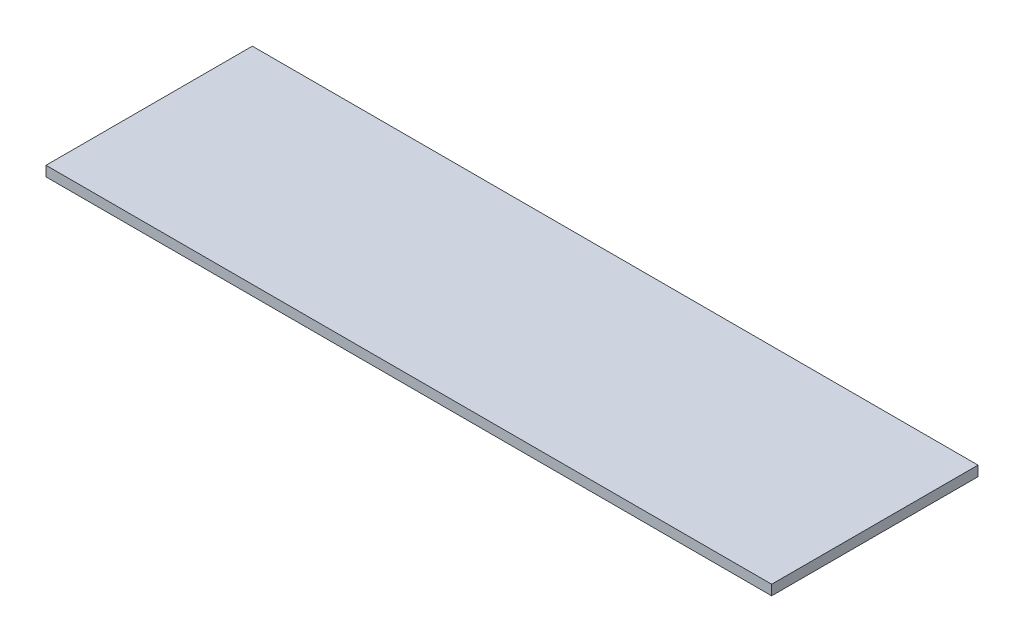
ISO-10303-21;
HEADER;
FILE_DESCRIPTION(('STEP AP214'),'2;1');
FILE_NAME('part.step','',(''),(''),'','','');
FILE_SCHEMA(('AUTOMOTIVE_DESIGN { 1 0 10303 214 1 1 1 1 }'));
ENDSEC;
DATA;
#1=APPLICATION_CONTEXT('core data for automotive mechanical design processes');
#2=APPLICATION_PROTOCOL_DEFINITION('international standard','automotive_design',2000,#1);
#3=PRODUCT_CONTEXT('',#1,'mechanical');
#4=PRODUCT('Part','Part','',(#3));
#5=PRODUCT_RELATED_PRODUCT_CATEGORY('part','',(#4));
#6=PRODUCT_DEFINITION_FORMATION('','',#4);
#7=PRODUCT_DEFINITION_CONTEXT('part definition',#1,'design');
#8=PRODUCT_DEFINITION('design','',#6,#7);
#9=PRODUCT_DEFINITION_SHAPE('','',#8);
#10=(LENGTH_UNIT() NAMED_UNIT(*) SI_UNIT(.MILLI.,.METRE.));
#11=(NAMED_UNIT(*) PLANE_ANGLE_UNIT() SI_UNIT($,.RADIAN.));
#12=(NAMED_UNIT(*) SI_UNIT($,.STERADIAN.) SOLID_ANGLE_UNIT());
#13=UNCERTAINTY_MEASURE_WITH_UNIT(LENGTH_MEASURE(1.E-05),#10,'distance_accuracy_value','');
#14=(GEOMETRIC_REPRESENTATION_CONTEXT(3) GLOBAL_UNCERTAINTY_ASSIGNED_CONTEXT((#13)) GLOBAL_UNIT_ASSIGNED_CONTEXT((#10,
#11,#12)) REPRESENTATION_CONTEXT('',''));
#15=CARTESIAN_POINT('',(0.,0.,0.));
#16=DIRECTION('',(0.,0.,1.));
#17=DIRECTION('',(1.,0.,0.));
#18=AXIS2_PLACEMENT_3D('',#15,#16,#17);
#19=CARTESIAN_POINT('',(0.,6.35,0.));
#20=DIRECTION('',(1.,0.,0.));
#21=DIRECTION('',(0.,0.,-1.));
#22=AXIS2_PLACEMENT_3D('',#19,#20,#21);
#23=PLANE('',#22);
#24=DIRECTION('',(0.,0.,1.));
#25=VECTOR('',#24,1.);
#26=CARTESIAN_POINT('',(0.,0.,0.));
#27=LINE('',#26,#25);
#28=CARTESIAN_POINT('',(0.,0.,-130.));
#29=VERTEX_POINT('',#28);
#30=CARTESIAN_POINT('',(0.,0.,0.));
#31=VERTEX_POINT('',#30);
#32=EDGE_CURVE('E96',#29,#31,#27,.T.);
#33=ORIENTED_EDGE('',*,*,#32,.T.);
#34=DIRECTION('',(0.,-1.,0.));
#35=VECTOR('',#34,1.);
#36=CARTESIAN_POINT('',(0.,6.35,0.));
#37=LINE('',#36,#35);
#38=CARTESIAN_POINT('',(0.,6.35,0.));
#39=VERTEX_POINT('',#38);
#40=EDGE_CURVE('E11',#39,#31,#37,.T.);
#41=ORIENTED_EDGE('',*,*,#40,.F.);
#42=DIRECTION('',(0.,0.,1.));
#43=VECTOR('',#42,1.);
#44=CARTESIAN_POINT('',(0.,6.35,0.));
#45=LINE('',#44,#43);
#46=CARTESIAN_POINT('',(0.,6.35,-130.));
#47=VERTEX_POINT('',#46);
#48=EDGE_CURVE('E84',#47,#39,#45,.T.);
#49=ORIENTED_EDGE('',*,*,#48,.F.);
#50=DIRECTION('',(0.,-1.,0.));
#51=VECTOR('',#50,1.);
#52=CARTESIAN_POINT('',(0.,6.35,-130.));
#53=LINE('',#52,#51);
#54=EDGE_CURVE('E92',#47,#29,#53,.T.);
#55=ORIENTED_EDGE('',*,*,#54,.T.);
#56=EDGE_LOOP('',(#33,#41,#49,#55));
#57=FACE_BOUND('',#56,.T.);
#58=ADVANCED_FACE('F33',(#57),#23,.F.);
#59=CARTESIAN_POINT('',(0.,6.35,0.));
#60=DIRECTION('',(0.,0.,-1.));
#61=DIRECTION('',(-1.,0.,0.));
#62=AXIS2_PLACEMENT_3D('',#59,#60,#61);
#63=PLANE('',#62);
#64=DIRECTION('',(1.,0.,0.));
#65=VECTOR('',#64,1.);
#66=CARTESIAN_POINT('',(0.,0.,0.));
#67=LINE('',#66,#65);
#68=CARTESIAN_POINT('',(457.2,0.,0.));
#69=VERTEX_POINT('',#68);
#70=EDGE_CURVE('E88',#31,#69,#67,.T.);
#71=ORIENTED_EDGE('',*,*,#70,.T.);
#72=DIRECTION('',(0.,-1.,0.));
#73=VECTOR('',#72,1.);
#74=CARTESIAN_POINT('',(457.2,6.35,0.));
#75=LINE('',#74,#73);
#76=CARTESIAN_POINT('',(457.2,6.35,0.));
#77=VERTEX_POINT('',#76);
#78=EDGE_CURVE('E41',#77,#69,#75,.T.);
#79=ORIENTED_EDGE('',*,*,#78,.F.);
#80=DIRECTION('',(1.,0.,0.));
#81=VECTOR('',#80,1.);
#82=CARTESIAN_POINT('',(0.,6.35,0.));
#83=LINE('',#82,#81);
#84=EDGE_CURVE('E79',#39,#77,#83,.T.);
#85=ORIENTED_EDGE('',*,*,#84,.F.);
#86=ORIENTED_EDGE('',*,*,#40,.T.);
#87=EDGE_LOOP('',(#71,#79,#85,#86));
#88=FACE_BOUND('',#87,.T.);
#89=ADVANCED_FACE('F87',(#88),#63,.F.);
#90=CARTESIAN_POINT('',(457.2,6.35,0.));
#91=DIRECTION('',(-1.,0.,0.));
#92=DIRECTION('',(0.,0.,1.));
#93=AXIS2_PLACEMENT_3D('',#90,#91,#92);
#94=PLANE('',#93);
#95=DIRECTION('',(0.,0.,-1.));
#96=VECTOR('',#95,1.);
#97=CARTESIAN_POINT('',(457.2,0.,0.));
#98=LINE('',#97,#96);
#99=CARTESIAN_POINT('',(457.2,0.,-130.));
#100=VERTEX_POINT('',#99);
#101=EDGE_CURVE('E66',#69,#100,#98,.T.);
#102=ORIENTED_EDGE('',*,*,#101,.T.);
#103=DIRECTION('',(0.,-1.,0.));
#104=VECTOR('',#103,1.);
#105=CARTESIAN_POINT('',(457.2,6.35,-130.));
#106=LINE('',#105,#104);
#107=CARTESIAN_POINT('',(457.2,6.35,-130.));
#108=VERTEX_POINT('',#107);
#109=EDGE_CURVE('E89',#108,#100,#106,.T.);
#110=ORIENTED_EDGE('',*,*,#109,.F.);
#111=DIRECTION('',(0.,0.,-1.));
#112=VECTOR('',#111,1.);
#113=CARTESIAN_POINT('',(457.2,6.35,0.));
#114=LINE('',#113,#112);
#115=EDGE_CURVE('E82',#77,#108,#114,.T.);
#116=ORIENTED_EDGE('',*,*,#115,.F.);
#117=ORIENTED_EDGE('',*,*,#78,.T.);
#118=EDGE_LOOP('',(#102,#110,#116,#117));
#119=FACE_BOUND('',#118,.T.);
#120=ADVANCED_FACE('F90',(#119),#94,.F.);
#121=CARTESIAN_POINT('',(0.,6.35,-130.));
#122=DIRECTION('',(0.,0.,1.));
#123=DIRECTION('',(1.,0.,0.));
#124=AXIS2_PLACEMENT_3D('',#121,#122,#123);
#125=PLANE('',#124);
#126=DIRECTION('',(-1.,0.,0.));
#127=VECTOR('',#126,1.);
#128=CARTESIAN_POINT('',(0.,0.,-130.));
#129=LINE('',#128,#127);
#130=EDGE_CURVE('E72',#100,#29,#129,.T.);
#131=ORIENTED_EDGE('',*,*,#130,.T.);
#132=ORIENTED_EDGE('',*,*,#54,.F.);
#133=DIRECTION('',(-1.,0.,0.));
#134=VECTOR('',#133,1.);
#135=CARTESIAN_POINT('',(0.,6.35,-130.));
#136=LINE('',#135,#134);
#137=EDGE_CURVE('E49',#108,#47,#136,.T.);
#138=ORIENTED_EDGE('',*,*,#137,.F.);
#139=ORIENTED_EDGE('',*,*,#109,.T.);
#140=EDGE_LOOP('',(#131,#132,#138,#139));
#141=FACE_BOUND('',#140,.T.);
#142=ADVANCED_FACE('F103',(#141),#125,.F.);
#143=CARTESIAN_POINT('',(0.,6.35,0.));
#144=DIRECTION('',(0.,-1.,0.));
#145=DIRECTION('',(0.,0.,-1.));
#146=AXIS2_PLACEMENT_3D('',#143,#144,#145);
#147=PLANE('',#146);
#148=ORIENTED_EDGE('',*,*,#48,.T.);
#149=ORIENTED_EDGE('',*,*,#84,.T.);
#150=ORIENTED_EDGE('',*,*,#115,.T.);
#151=ORIENTED_EDGE('',*,*,#137,.T.);
#152=EDGE_LOOP('',(#148,#149,#150,#151));
#153=FACE_BOUND('',#152,.T.);
#154=ADVANCED_FACE('F80',(#153),#147,.F.);
#155=CARTESIAN_POINT('',(0.,0.,0.));
#156=DIRECTION('',(0.,-1.,0.));
#157=DIRECTION('',(0.,0.,-1.));
#158=AXIS2_PLACEMENT_3D('',#155,#156,#157);
#159=PLANE('',#158);
#160=ORIENTED_EDGE('',*,*,#32,.F.);
#161=ORIENTED_EDGE('',*,*,#130,.F.);
#162=ORIENTED_EDGE('',*,*,#101,.F.);
#163=ORIENTED_EDGE('',*,*,#70,.F.);
#164=EDGE_LOOP('',(#160,#161,#162,#163));
#165=FACE_BOUND('',#164,.T.);
#166=ADVANCED_FACE('F106',(#165),#159,.T.);
#167=CLOSED_SHELL('',(#58,#89,#120,#142,#154,#166));
#168=MANIFOLD_SOLID_BREP('B2',#167);
#169=ADVANCED_BREP_SHAPE_REPRESENTATION('',(#18,#168),#14);
#170=SHAPE_DEFINITION_REPRESENTATION(#9,#169);
ENDSEC;
END-ISO-10303-21;
